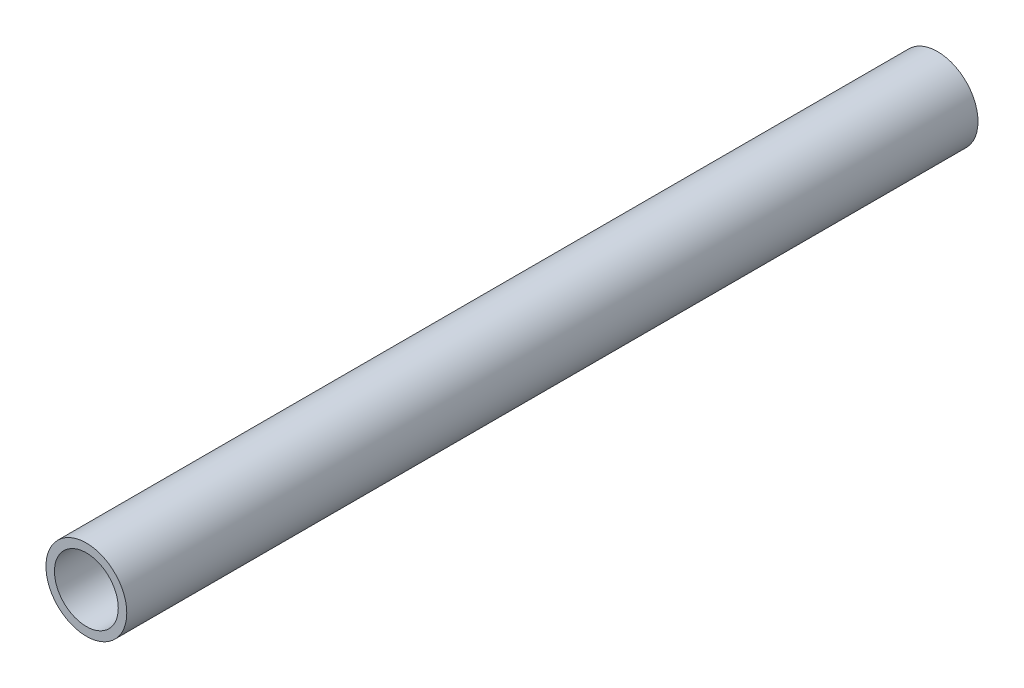
ISO-10303-21;
HEADER;
FILE_DESCRIPTION(('STEP AP214'),'2;1');
FILE_NAME('part.step','',(''),(''),'','','');
FILE_SCHEMA(('AUTOMOTIVE_DESIGN { 1 0 10303 214 1 1 1 1 }'));
ENDSEC;
DATA;
#1=APPLICATION_CONTEXT('core data for automotive mechanical design processes');
#2=APPLICATION_PROTOCOL_DEFINITION('international standard','automotive_design',2000,#1);
#3=PRODUCT_CONTEXT('',#1,'mechanical');
#4=PRODUCT('Part','Part','',(#3));
#5=PRODUCT_RELATED_PRODUCT_CATEGORY('part','',(#4));
#6=PRODUCT_DEFINITION_FORMATION('','',#4);
#7=PRODUCT_DEFINITION_CONTEXT('part definition',#1,'design');
#8=PRODUCT_DEFINITION('design','',#6,#7);
#9=PRODUCT_DEFINITION_SHAPE('','',#8);
#10=(LENGTH_UNIT() NAMED_UNIT(*) SI_UNIT(.MILLI.,.METRE.));
#11=(NAMED_UNIT(*) PLANE_ANGLE_UNIT() SI_UNIT($,.RADIAN.));
#12=(NAMED_UNIT(*) SI_UNIT($,.STERADIAN.) SOLID_ANGLE_UNIT());
#13=UNCERTAINTY_MEASURE_WITH_UNIT(LENGTH_MEASURE(1.E-05),#10,'distance_accuracy_value','');
#14=(GEOMETRIC_REPRESENTATION_CONTEXT(3) GLOBAL_UNCERTAINTY_ASSIGNED_CONTEXT((#13)) GLOBAL_UNIT_ASSIGNED_CONTEXT((#10,
#11,#12)) REPRESENTATION_CONTEXT('',''));
#15=CARTESIAN_POINT('',(0.,0.,0.));
#16=DIRECTION('',(0.,0.,1.));
#17=DIRECTION('',(1.,0.,0.));
#18=AXIS2_PLACEMENT_3D('',#15,#16,#17);
#19=CARTESIAN_POINT('',(0.,0.,200.));
#20=DIRECTION('',(0.,0.,1.));
#21=DIRECTION('',(1.,0.,0.));
#22=AXIS2_PLACEMENT_3D('',#19,#20,#21);
#23=PLANE('',#22);
#24=CARTESIAN_POINT('',(0.,0.,200.));
#25=DIRECTION('',(0.,0.,1.));
#26=DIRECTION('',(1.,0.,0.));
#27=AXIS2_PLACEMENT_3D('',#24,#25,#26);
#28=CIRCLE('',#27,9.5);
#29=CARTESIAN_POINT('',(9.5,0.,200.));
#30=VERTEX_POINT('',#29);
#31=EDGE_CURVE('E10',#30,#30,#28,.T.);
#32=ORIENTED_EDGE('',*,*,#31,.T.);
#33=EDGE_LOOP('',(#32));
#34=FACE_BOUND('',#33,.T.);
#35=CARTESIAN_POINT('',(0.,0.,200.));
#36=DIRECTION('',(0.,0.,1.));
#37=DIRECTION('',(1.,0.,0.));
#38=AXIS2_PLACEMENT_3D('',#35,#36,#37);
#39=CIRCLE('',#38,7.5);
#40=CARTESIAN_POINT('',(7.5,0.,200.));
#41=VERTEX_POINT('',#40);
#42=EDGE_CURVE('E42',#41,#41,#39,.T.);
#43=ORIENTED_EDGE('',*,*,#42,.F.);
#44=EDGE_LOOP('',(#43));
#45=FACE_BOUND('',#44,.T.);
#46=ADVANCED_FACE('F31',(#34,#45),#23,.T.);
#47=CARTESIAN_POINT('',(0.,0.,0.));
#48=DIRECTION('',(0.,0.,1.));
#49=DIRECTION('',(1.,0.,0.));
#50=AXIS2_PLACEMENT_3D('',#47,#48,#49);
#51=PLANE('',#50);
#52=CARTESIAN_POINT('',(0.,0.,0.));
#53=DIRECTION('',(0.,0.,1.));
#54=DIRECTION('',(1.,0.,0.));
#55=AXIS2_PLACEMENT_3D('',#52,#53,#54);
#56=CIRCLE('',#55,9.5);
#57=CARTESIAN_POINT('',(9.5,0.,0.));
#58=VERTEX_POINT('',#57);
#59=EDGE_CURVE('E35',#58,#58,#56,.T.);
#60=ORIENTED_EDGE('',*,*,#59,.F.);
#61=EDGE_LOOP('',(#60));
#62=FACE_BOUND('',#61,.T.);
#63=CARTESIAN_POINT('',(0.,0.,0.));
#64=DIRECTION('',(0.,0.,1.));
#65=DIRECTION('',(1.,0.,0.));
#66=AXIS2_PLACEMENT_3D('',#63,#64,#65);
#67=CIRCLE('',#66,7.5);
#68=CARTESIAN_POINT('',(7.5,0.,0.));
#69=VERTEX_POINT('',#68);
#70=EDGE_CURVE('E44',#69,#69,#67,.T.);
#71=ORIENTED_EDGE('',*,*,#70,.T.);
#72=EDGE_LOOP('',(#71));
#73=FACE_BOUND('',#72,.T.);
#74=ADVANCED_FACE('F54',(#62,#73),#51,.F.);
#75=CARTESIAN_POINT('',(0.,0.,200.));
#76=DIRECTION('',(0.,0.,-1.));
#77=DIRECTION('',(-1.,0.,0.));
#78=AXIS2_PLACEMENT_3D('',#75,#76,#77);
#79=CYLINDRICAL_SURFACE('',#78,9.5);
#80=ORIENTED_EDGE('',*,*,#31,.F.);
#81=EDGE_LOOP('',(#80));
#82=FACE_BOUND('',#81,.T.);
#83=ORIENTED_EDGE('',*,*,#59,.T.);
#84=EDGE_LOOP('',(#83));
#85=FACE_BOUND('',#84,.T.);
#86=ADVANCED_FACE('F33',(#82,#85),#79,.T.);
#87=CARTESIAN_POINT('',(0.,0.,200.));
#88=DIRECTION('',(0.,0.,-1.));
#89=DIRECTION('',(-1.,0.,0.));
#90=AXIS2_PLACEMENT_3D('',#87,#88,#89);
#91=CYLINDRICAL_SURFACE('',#90,7.5);
#92=ORIENTED_EDGE('',*,*,#42,.T.);
#93=EDGE_LOOP('',(#92));
#94=FACE_BOUND('',#93,.T.);
#95=ORIENTED_EDGE('',*,*,#70,.F.);
#96=EDGE_LOOP('',(#95));
#97=FACE_BOUND('',#96,.T.);
#98=ADVANCED_FACE('F50',(#94,#97),#91,.F.);
#99=CLOSED_SHELL('',(#46,#74,#86,#98));
#100=MANIFOLD_SOLID_BREP('B2',#99);
#101=ADVANCED_BREP_SHAPE_REPRESENTATION('',(#18,#100),#14);
#102=SHAPE_DEFINITION_REPRESENTATION(#9,#101);
ENDSEC;
END-ISO-10303-21;
